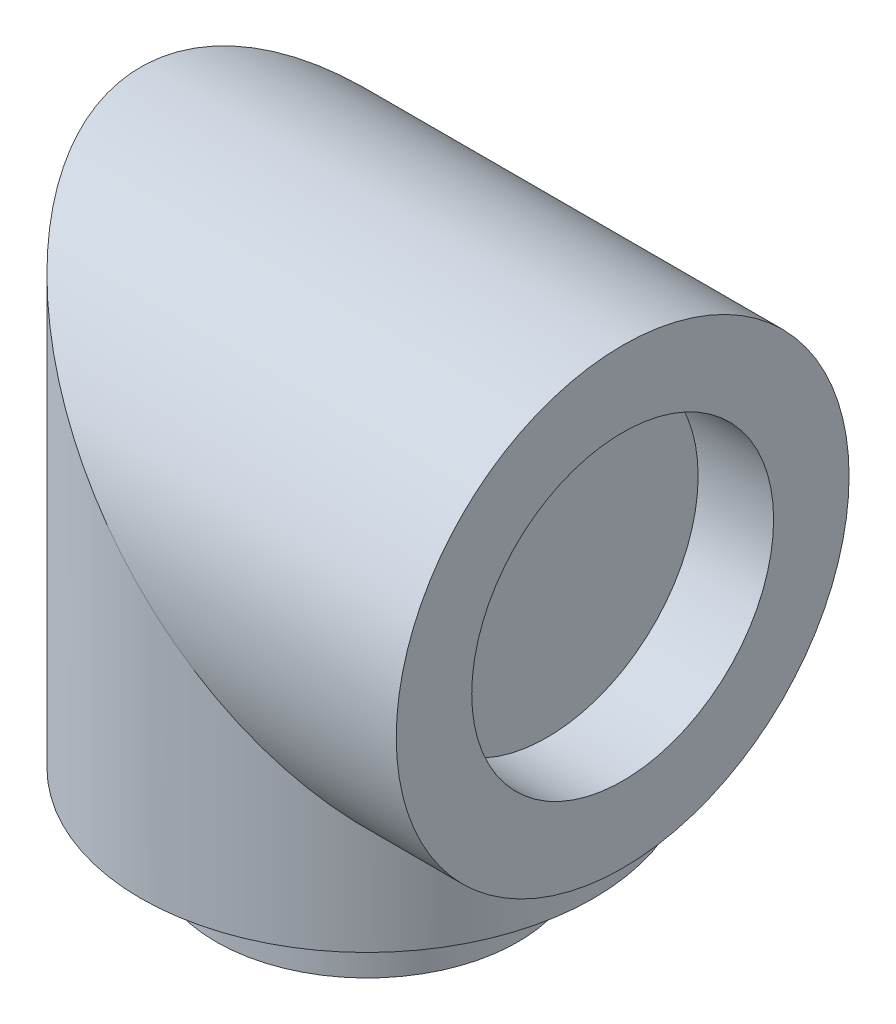
ISO-10303-21;
HEADER;
FILE_DESCRIPTION(('STEP AP214'),'2;1');
FILE_NAME('part.step','',(''),(''),'','','');
FILE_SCHEMA(('AUTOMOTIVE_DESIGN { 1 0 10303 214 1 1 1 1 }'));
ENDSEC;
DATA;
#1=APPLICATION_CONTEXT('core data for automotive mechanical design processes');
#2=APPLICATION_PROTOCOL_DEFINITION('international standard','automotive_design',2000,#1);
#3=PRODUCT_CONTEXT('',#1,'mechanical');
#4=PRODUCT('Part','Part','',(#3));
#5=PRODUCT_RELATED_PRODUCT_CATEGORY('part','',(#4));
#6=PRODUCT_DEFINITION_FORMATION('','',#4);
#7=PRODUCT_DEFINITION_CONTEXT('part definition',#1,'design');
#8=PRODUCT_DEFINITION('design','',#6,#7);
#9=PRODUCT_DEFINITION_SHAPE('','',#8);
#10=(LENGTH_UNIT() NAMED_UNIT(*) SI_UNIT(.MILLI.,.METRE.));
#11=(NAMED_UNIT(*) PLANE_ANGLE_UNIT() SI_UNIT($,.RADIAN.));
#12=(NAMED_UNIT(*) SI_UNIT($,.STERADIAN.) SOLID_ANGLE_UNIT());
#13=UNCERTAINTY_MEASURE_WITH_UNIT(LENGTH_MEASURE(1.E-05),#10,'distance_accuracy_value','');
#14=(GEOMETRIC_REPRESENTATION_CONTEXT(3) GLOBAL_UNCERTAINTY_ASSIGNED_CONTEXT((#13)) GLOBAL_UNIT_ASSIGNED_CONTEXT((#10,
#11,#12)) REPRESENTATION_CONTEXT('',''));
#15=CARTESIAN_POINT('',(0.,0.,0.));
#16=DIRECTION('',(0.,0.,1.));
#17=DIRECTION('',(1.,0.,0.));
#18=AXIS2_PLACEMENT_3D('',#15,#16,#17);
#19=CARTESIAN_POINT('',(86.,115.3,0.));
#20=DIRECTION('',(-1.,0.,0.));
#21=DIRECTION('',(0.,0.,1.));
#22=AXIS2_PLACEMENT_3D('',#19,#20,#21);
#23=CYLINDRICAL_SURFACE('',#22,76.2);
#24=CARTESIAN_POINT('',(86.,115.3,0.));
#25=DIRECTION('',(1.,0.,0.));
#26=DIRECTION('',(0.,0.,-1.));
#27=AXIS2_PLACEMENT_3D('',#24,#25,#26);
#28=CIRCLE('',#27,76.2);
#29=CARTESIAN_POINT('',(86.,115.3,-76.2));
#30=VERTEX_POINT('',#29);
#31=EDGE_CURVE('E59',#30,#30,#28,.T.);
#32=ORIENTED_EDGE('',*,*,#31,.F.);
#33=EDGE_LOOP('',(#32));
#34=FACE_BOUND('',#33,.T.);
#35=CARTESIAN_POINT('',(0.,115.3,0.));
#36=DIRECTION('',(-0.707106781186547,-0.707106781186547,0.));
#37=DIRECTION('',(0.707106781186547,-0.707106781186547,0.));
#38=AXIS2_PLACEMENT_3D('',#35,#36,#37);
#39=ELLIPSE('',#38,107.76307345283,76.2);
#40=CARTESIAN_POINT('',(76.2,39.1000000000001,0.));
#41=VERTEX_POINT('',#40);
#42=EDGE_CURVE('E56',#41,#41,#39,.F.);
#43=ORIENTED_EDGE('',*,*,#42,.T.);
#44=EDGE_LOOP('',(#43));
#45=FACE_BOUND('',#44,.T.);
#46=ADVANCED_FACE('F41',(#34,#45),#23,.T.);
#47=CARTESIAN_POINT('',(0.,115.3,0.));
#48=DIRECTION('',(0.,-1.,0.));
#49=DIRECTION('',(0.,0.,-1.));
#50=AXIS2_PLACEMENT_3D('',#47,#48,#49);
#51=CYLINDRICAL_SURFACE('',#50,76.2);
#52=ORIENTED_EDGE('',*,*,#42,.F.);
#53=EDGE_LOOP('',(#52));
#54=FACE_BOUND('',#53,.T.);
#55=CARTESIAN_POINT('',(0.,25.4,0.));
#56=DIRECTION('',(0.,1.,0.));
#57=DIRECTION('',(0.,0.,1.));
#58=AXIS2_PLACEMENT_3D('',#55,#56,#57);
#59=CIRCLE('',#58,76.2);
#60=CARTESIAN_POINT('',(0.,25.4,76.2));
#61=VERTEX_POINT('',#60);
#62=EDGE_CURVE('E52',#61,#61,#59,.T.);
#63=ORIENTED_EDGE('',*,*,#62,.T.);
#64=EDGE_LOOP('',(#63));
#65=FACE_BOUND('',#64,.T.);
#66=ADVANCED_FACE('F86',(#54,#65),#51,.T.);
#67=CARTESIAN_POINT('',(0.,25.4,0.));
#68=DIRECTION('',(0.,-1.,0.));
#69=DIRECTION('',(0.,0.,-1.));
#70=AXIS2_PLACEMENT_3D('',#67,#68,#69);
#71=CYLINDRICAL_SURFACE('',#70,50.8);
#72=CARTESIAN_POINT('',(0.,25.4,0.));
#73=DIRECTION('',(0.,1.,0.));
#74=DIRECTION('',(0.,0.,1.));
#75=AXIS2_PLACEMENT_3D('',#72,#73,#74);
#76=CIRCLE('',#75,50.8);
#77=CARTESIAN_POINT('',(0.,25.4,50.8));
#78=VERTEX_POINT('',#77);
#79=EDGE_CURVE('E10',#78,#78,#76,.T.);
#80=ORIENTED_EDGE('',*,*,#79,.F.);
#81=EDGE_LOOP('',(#80));
#82=FACE_BOUND('',#81,.T.);
#83=CARTESIAN_POINT('',(0.,0.,0.));
#84=DIRECTION('',(0.,1.,0.));
#85=DIRECTION('',(0.,0.,1.));
#86=AXIS2_PLACEMENT_3D('',#83,#84,#85);
#87=CIRCLE('',#86,50.8);
#88=CARTESIAN_POINT('',(0.,0.,50.8));
#89=VERTEX_POINT('',#88);
#90=EDGE_CURVE('E45',#89,#89,#87,.T.);
#91=ORIENTED_EDGE('',*,*,#90,.T.);
#92=EDGE_LOOP('',(#91));
#93=FACE_BOUND('',#92,.T.);
#94=ADVANCED_FACE('F43',(#82,#93),#71,.T.);
#95=CARTESIAN_POINT('',(0.,0.,0.));
#96=DIRECTION('',(0.,1.,0.));
#97=DIRECTION('',(0.,0.,1.));
#98=AXIS2_PLACEMENT_3D('',#95,#96,#97);
#99=PLANE('',#98);
#100=ORIENTED_EDGE('',*,*,#90,.F.);
#101=EDGE_LOOP('',(#100));
#102=FACE_BOUND('',#101,.T.);
#103=ADVANCED_FACE('F96',(#102),#99,.F.);
#104=CARTESIAN_POINT('',(0.,25.4,0.));
#105=DIRECTION('',(0.,1.,0.));
#106=DIRECTION('',(0.,0.,1.));
#107=AXIS2_PLACEMENT_3D('',#104,#105,#106);
#108=PLANE('',#107);
#109=ORIENTED_EDGE('',*,*,#79,.T.);
#110=EDGE_LOOP('',(#109));
#111=FACE_BOUND('',#110,.T.);
#112=ORIENTED_EDGE('',*,*,#62,.F.);
#113=EDGE_LOOP('',(#112));
#114=FACE_BOUND('',#113,.T.);
#115=ADVANCED_FACE('F80',(#111,#114),#108,.F.);
#116=CARTESIAN_POINT('',(86.,115.3,0.));
#117=DIRECTION('',(1.,0.,0.));
#118=DIRECTION('',(0.,0.,-1.));
#119=AXIS2_PLACEMENT_3D('',#116,#117,#118);
#120=PLANE('',#119);
#121=CARTESIAN_POINT('',(86.,115.3,0.));
#122=DIRECTION('',(1.,0.,0.));
#123=DIRECTION('',(0.,0.,-1.));
#124=AXIS2_PLACEMENT_3D('',#121,#122,#123);
#125=CIRCLE('',#124,50.8);
#126=CARTESIAN_POINT('',(86.,115.3,-50.8));
#127=VERTEX_POINT('',#126);
#128=EDGE_CURVE('E63',#127,#127,#125,.T.);
#129=ORIENTED_EDGE('',*,*,#128,.F.);
#130=EDGE_LOOP('',(#129));
#131=FACE_BOUND('',#130,.T.);
#132=ORIENTED_EDGE('',*,*,#31,.T.);
#133=EDGE_LOOP('',(#132));
#134=FACE_BOUND('',#133,.T.);
#135=ADVANCED_FACE('F74',(#131,#134),#120,.T.);
#136=CARTESIAN_POINT('',(60.6,115.3,0.));
#137=DIRECTION('',(1.,0.,0.));
#138=DIRECTION('',(0.,0.,-1.));
#139=AXIS2_PLACEMENT_3D('',#136,#137,#138);
#140=CYLINDRICAL_SURFACE('',#139,50.8);
#141=CARTESIAN_POINT('',(60.6,115.3,0.));
#142=DIRECTION('',(1.,0.,0.));
#143=DIRECTION('',(0.,0.,-1.));
#144=AXIS2_PLACEMENT_3D('',#141,#142,#143);
#145=CIRCLE('',#144,50.8);
#146=CARTESIAN_POINT('',(60.6,115.3,-50.8));
#147=VERTEX_POINT('',#146);
#148=EDGE_CURVE('E62',#147,#147,#145,.T.);
#149=ORIENTED_EDGE('',*,*,#148,.F.);
#150=EDGE_LOOP('',(#149));
#151=FACE_BOUND('',#150,.T.);
#152=ORIENTED_EDGE('',*,*,#128,.T.);
#153=EDGE_LOOP('',(#152));
#154=FACE_BOUND('',#153,.T.);
#155=ADVANCED_FACE('F71',(#151,#154),#140,.F.);
#156=CARTESIAN_POINT('',(60.6,115.3,0.));
#157=DIRECTION('',(1.,0.,0.));
#158=DIRECTION('',(0.,0.,-1.));
#159=AXIS2_PLACEMENT_3D('',#156,#157,#158);
#160=PLANE('',#159);
#161=ORIENTED_EDGE('',*,*,#148,.T.);
#162=EDGE_LOOP('',(#161));
#163=FACE_BOUND('',#162,.T.);
#164=ADVANCED_FACE('F69',(#163),#160,.T.);
#165=CLOSED_SHELL('',(#46,#66,#94,#103,#115,#135,#155,#164));
#166=MANIFOLD_SOLID_BREP('B2',#165);
#167=ADVANCED_BREP_SHAPE_REPRESENTATION('',(#18,#166),#14);
#168=SHAPE_DEFINITION_REPRESENTATION(#9,#167);
ENDSEC;
END-ISO-10303-21;
